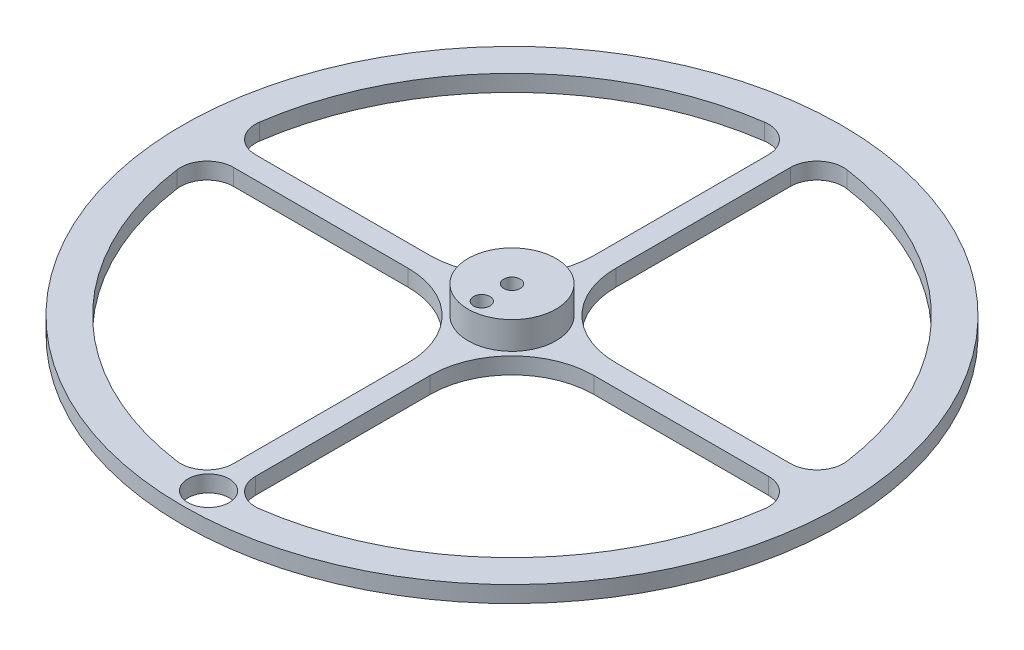
ISO-10303-21;
HEADER;
FILE_DESCRIPTION(('STEP AP214'),'2;1');
FILE_NAME('part.step','',(''),(''),'','','');
FILE_SCHEMA(('AUTOMOTIVE_DESIGN { 1 0 10303 214 1 1 1 1 }'));
ENDSEC;
DATA;
#1=APPLICATION_CONTEXT('core data for automotive mechanical design processes');
#2=APPLICATION_PROTOCOL_DEFINITION('international standard','automotive_design',2000,#1);
#3=PRODUCT_CONTEXT('',#1,'mechanical');
#4=PRODUCT('Part','Part','',(#3));
#5=PRODUCT_RELATED_PRODUCT_CATEGORY('part','',(#4));
#6=PRODUCT_DEFINITION_FORMATION('','',#4);
#7=PRODUCT_DEFINITION_CONTEXT('part definition',#1,'design');
#8=PRODUCT_DEFINITION('design','',#6,#7);
#9=PRODUCT_DEFINITION_SHAPE('','',#8);
#10=(LENGTH_UNIT() NAMED_UNIT(*) SI_UNIT(.MILLI.,.METRE.));
#11=(NAMED_UNIT(*) PLANE_ANGLE_UNIT() SI_UNIT($,.RADIAN.));
#12=(NAMED_UNIT(*) SI_UNIT($,.STERADIAN.) SOLID_ANGLE_UNIT());
#13=UNCERTAINTY_MEASURE_WITH_UNIT(LENGTH_MEASURE(1.E-05),#10,'distance_accuracy_value','');
#14=(GEOMETRIC_REPRESENTATION_CONTEXT(3) GLOBAL_UNCERTAINTY_ASSIGNED_CONTEXT((#13)) GLOBAL_UNIT_ASSIGNED_CONTEXT((#10,
#11,#12)) REPRESENTATION_CONTEXT('',''));
#15=CARTESIAN_POINT('',(0.,0.,0.));
#16=DIRECTION('',(0.,0.,1.));
#17=DIRECTION('',(1.,0.,0.));
#18=AXIS2_PLACEMENT_3D('',#15,#16,#17);
#19=CARTESIAN_POINT('',(0.,0.,0.));
#20=DIRECTION('',(0.,1.,0.));
#21=DIRECTION('',(0.,0.,1.));
#22=AXIS2_PLACEMENT_3D('',#19,#20,#21);
#23=PLANE('',#22);
#24=CARTESIAN_POINT('',(0.,0.,55.25));
#25=DIRECTION('',(0.,1.,0.));
#26=DIRECTION('',(0.,0.,1.));
#27=AXIS2_PLACEMENT_3D('',#24,#25,#26);
#28=CIRCLE('',#27,3.75);
#29=CARTESIAN_POINT('',(0.,0.,59.));
#30=VERTEX_POINT('',#29);
#31=EDGE_CURVE('E601',#30,#30,#28,.T.);
#32=ORIENTED_EDGE('',*,*,#31,.F.);
#33=EDGE_LOOP('',(#32));
#34=FACE_BOUND('',#33,.T.);
#35=CARTESIAN_POINT('',(0.,0.,0.));
#36=DIRECTION('',(0.,1.,0.));
#37=DIRECTION('',(0.,0.,1.));
#38=AXIS2_PLACEMENT_3D('',#35,#36,#37);
#39=CIRCLE('',#38,60.);
#40=CARTESIAN_POINT('',(0.,0.,60.));
#41=VERTEX_POINT('',#40);
#42=EDGE_CURVE('E293',#41,#41,#39,.T.);
#43=ORIENTED_EDGE('',*,*,#42,.T.);
#44=EDGE_LOOP('',(#43));
#45=FACE_BOUND('',#44,.T.);
#46=CARTESIAN_POINT('',(0.,0.,0.));
#47=DIRECTION('',(0.,1.,0.));
#48=DIRECTION('',(0.,0.,1.));
#49=AXIS2_PLACEMENT_3D('',#46,#47,#48);
#50=CIRCLE('',#49,54.);
#51=CARTESIAN_POINT('',(-53.4766304099277,0.,7.49999999999981));
#52=VERTEX_POINT('',#51);
#53=CARTESIAN_POINT('',(-7.5,0.,53.4766304099277));
#54=VERTEX_POINT('',#53);
#55=EDGE_CURVE('E238',#52,#54,#50,.T.);
#56=ORIENTED_EDGE('',*,*,#55,.F.);
#57=CARTESIAN_POINT('',(-48.6941677054723,0.,6.82926831760953));
#58=DIRECTION('',(0.,1.,0.));
#59=DIRECTION('',(0.,0.,1.));
#60=AXIS2_PLACEMENT_3D('',#57,#58,#59);
#61=CIRCLE('',#60,4.8292681132102);
#62=CARTESIAN_POINT('',(-48.6941677054723,0.,2.00000020439934));
#63=VERTEX_POINT('',#62);
#64=EDGE_CURVE('E282',#63,#52,#61,.T.);
#65=ORIENTED_EDGE('',*,*,#64,.F.);
#66=DIRECTION('',(1.,0.,0.));
#67=VECTOR('',#66,1.);
#68=CARTESIAN_POINT('',(0.,0.,2.00000020439951));
#69=LINE('',#68,#67);
#70=CARTESIAN_POINT('',(-16.8994944431475,0.,2.00000020439945));
#71=VERTEX_POINT('',#70);
#72=EDGE_CURVE('E284',#63,#71,#69,.T.);
#73=ORIENTED_EDGE('',*,*,#72,.T.);
#74=CARTESIAN_POINT('',(-16.8994944431475,0.,16.8994944431472));
#75=DIRECTION('',(0.,1.,0.));
#76=DIRECTION('',(0.,0.,1.));
#77=AXIS2_PLACEMENT_3D('',#74,#75,#76);
#78=CIRCLE('',#77,14.8994942387478);
#79=CARTESIAN_POINT('',(-2.00000020439951,0.,16.8994944431475));
#80=VERTEX_POINT('',#79);
#81=EDGE_CURVE('E287',#71,#80,#78,.F.);
#82=ORIENTED_EDGE('',*,*,#81,.T.);
#83=DIRECTION('',(0.,0.,1.));
#84=VECTOR('',#83,1.);
#85=CARTESIAN_POINT('',(-2.00000020439951,0.,0.));
#86=LINE('',#85,#84);
#87=CARTESIAN_POINT('',(-2.00000020439951,0.,48.6941677054723));
#88=VERTEX_POINT('',#87);
#89=EDGE_CURVE('E207',#80,#88,#86,.T.);
#90=ORIENTED_EDGE('',*,*,#89,.T.);
#91=CARTESIAN_POINT('',(-6.8292683176097,0.,48.6941677054723));
#92=DIRECTION('',(0.,1.,0.));
#93=DIRECTION('',(0.,0.,1.));
#94=AXIS2_PLACEMENT_3D('',#91,#92,#93);
#95=CIRCLE('',#94,4.82926811321019);
#96=EDGE_CURVE('E290',#88,#54,#95,.F.);
#97=ORIENTED_EDGE('',*,*,#96,.T.);
#98=EDGE_LOOP('',(#56,#65,#73,#82,#90,#97));
#99=FACE_BOUND('',#98,.T.);
#100=CARTESIAN_POINT('',(-7.49999999999963,0.,-53.4766304099277));
#101=VERTEX_POINT('',#100);
#102=CARTESIAN_POINT('',(-53.4766304099276,0.,-7.50000000000019));
#103=VERTEX_POINT('',#102);
#104=EDGE_CURVE('E267',#101,#103,#50,.T.);
#105=ORIENTED_EDGE('',*,*,#104,.F.);
#106=CARTESIAN_POINT('',(-6.82926831760936,0.,-48.6941677054723));
#107=DIRECTION('',(0.,1.,0.));
#108=DIRECTION('',(0.,0.,1.));
#109=AXIS2_PLACEMENT_3D('',#106,#107,#108);
#110=CIRCLE('',#109,4.82926811321019);
#111=CARTESIAN_POINT('',(-2.00000020439917,0.,-48.6941677054723));
#112=VERTEX_POINT('',#111);
#113=EDGE_CURVE('E268',#112,#101,#110,.T.);
#114=ORIENTED_EDGE('',*,*,#113,.F.);
#115=DIRECTION('',(0.,0.,1.));
#116=VECTOR('',#115,1.);
#117=CARTESIAN_POINT('',(-2.00000020439951,0.,0.));
#118=LINE('',#117,#116);
#119=CARTESIAN_POINT('',(-2.00000020439939,0.,-16.8994944431475));
#120=VERTEX_POINT('',#119);
#121=EDGE_CURVE('E270',#112,#120,#118,.T.);
#122=ORIENTED_EDGE('',*,*,#121,.T.);
#123=CARTESIAN_POINT('',(-16.8994944431471,0.,-16.8994944431476));
#124=DIRECTION('',(0.,1.,0.));
#125=DIRECTION('',(0.,0.,1.));
#126=AXIS2_PLACEMENT_3D('',#123,#124,#125);
#127=CIRCLE('',#126,14.8994942387477);
#128=CARTESIAN_POINT('',(-16.8994944431475,0.,-2.00000020439957));
#129=VERTEX_POINT('',#128);
#130=EDGE_CURVE('E273',#120,#129,#127,.F.);
#131=ORIENTED_EDGE('',*,*,#130,.T.);
#132=DIRECTION('',(-1.,0.,0.));
#133=VECTOR('',#132,1.);
#134=CARTESIAN_POINT('',(0.,0.,-2.00000020439951));
#135=LINE('',#134,#133);
#136=CARTESIAN_POINT('',(-48.6941677054723,0.,-2.00000020439968));
#137=VERTEX_POINT('',#136);
#138=EDGE_CURVE('E276',#129,#137,#135,.T.);
#139=ORIENTED_EDGE('',*,*,#138,.T.);
#140=CARTESIAN_POINT('',(-48.6941677054723,0.,-6.82926831760987));
#141=DIRECTION('',(0.,1.,0.));
#142=DIRECTION('',(0.,0.,1.));
#143=AXIS2_PLACEMENT_3D('',#140,#141,#142);
#144=CIRCLE('',#143,4.82926811321019);
#145=EDGE_CURVE('E279',#137,#103,#144,.F.);
#146=ORIENTED_EDGE('',*,*,#145,.T.);
#147=EDGE_LOOP('',(#105,#114,#122,#131,#139,#146));
#148=FACE_BOUND('',#147,.T.);
#149=CARTESIAN_POINT('',(53.4766304099277,0.,-7.49999999999944));
#150=VERTEX_POINT('',#149);
#151=CARTESIAN_POINT('',(7.50000000000037,0.,-53.4766304099276));
#152=VERTEX_POINT('',#151);
#153=EDGE_CURVE('E239',#150,#152,#50,.T.);
#154=ORIENTED_EDGE('',*,*,#153,.F.);
#155=CARTESIAN_POINT('',(48.6941677054724,0.,-6.82926831760919));
#156=DIRECTION('',(0.,1.,0.));
#157=DIRECTION('',(0.,0.,1.));
#158=AXIS2_PLACEMENT_3D('',#155,#156,#157);
#159=CIRCLE('',#158,4.82926811321019);
#160=CARTESIAN_POINT('',(48.6941677054723,0.,-2.000000204399));
#161=VERTEX_POINT('',#160);
#162=EDGE_CURVE('E253',#161,#150,#159,.T.);
#163=ORIENTED_EDGE('',*,*,#162,.F.);
#164=DIRECTION('',(-1.,0.,0.));
#165=VECTOR('',#164,1.);
#166=CARTESIAN_POINT('',(0.,0.,-2.00000020439951));
#167=LINE('',#166,#165);
#168=CARTESIAN_POINT('',(16.8994944431475,0.,-2.00000020439933));
#169=VERTEX_POINT('',#168);
#170=EDGE_CURVE('E255',#161,#169,#167,.T.);
#171=ORIENTED_EDGE('',*,*,#170,.T.);
#172=CARTESIAN_POINT('',(16.8994944431476,0.,-16.8994944431471));
#173=DIRECTION('',(0.,1.,0.));
#174=DIRECTION('',(0.,0.,1.));
#175=AXIS2_PLACEMENT_3D('',#172,#173,#174);
#176=CIRCLE('',#175,14.8994942387478);
#177=CARTESIAN_POINT('',(2.00000020439962,0.,-16.8994944431474));
#178=VERTEX_POINT('',#177);
#179=EDGE_CURVE('E258',#169,#178,#176,.F.);
#180=ORIENTED_EDGE('',*,*,#179,.T.);
#181=DIRECTION('',(0.,0.,-1.));
#182=VECTOR('',#181,1.);
#183=CARTESIAN_POINT('',(2.0000002043995,0.,0.));
#184=LINE('',#183,#182);
#185=CARTESIAN_POINT('',(2.00000020439984,0.,-48.6941677054723));
#186=VERTEX_POINT('',#185);
#187=EDGE_CURVE('E261',#178,#186,#184,.T.);
#188=ORIENTED_EDGE('',*,*,#187,.T.);
#189=CARTESIAN_POINT('',(6.82926831761003,0.,-48.6941677054722));
#190=DIRECTION('',(0.,1.,0.));
#191=DIRECTION('',(0.,0.,1.));
#192=AXIS2_PLACEMENT_3D('',#189,#190,#191);
#193=CIRCLE('',#192,4.82926811321019);
#194=EDGE_CURVE('E264',#186,#152,#193,.F.);
#195=ORIENTED_EDGE('',*,*,#194,.T.);
#196=EDGE_LOOP('',(#154,#163,#171,#180,#188,#195));
#197=FACE_BOUND('',#196,.T.);
#198=CARTESIAN_POINT('',(7.5,0.,53.4766304099277));
#199=VERTEX_POINT('',#198);
#200=CARTESIAN_POINT('',(53.4766304099276,0.,7.50000000000056));
#201=VERTEX_POINT('',#200);
#202=EDGE_CURVE('E233',#199,#201,#50,.T.);
#203=ORIENTED_EDGE('',*,*,#202,.F.);
#204=CARTESIAN_POINT('',(6.8292683176097,0.,48.6941677054723));
#205=DIRECTION('',(0.,1.,0.));
#206=DIRECTION('',(0.,0.,1.));
#207=AXIS2_PLACEMENT_3D('',#204,#205,#206);
#208=CIRCLE('',#207,4.82926811321019);
#209=CARTESIAN_POINT('',(2.00000020439951,0.,48.6941677054723));
#210=VERTEX_POINT('',#209);
#211=EDGE_CURVE('E236',#210,#199,#208,.T.);
#212=ORIENTED_EDGE('',*,*,#211,.F.);
#213=DIRECTION('',(0.,0.,-1.));
#214=VECTOR('',#213,1.);
#215=CARTESIAN_POINT('',(2.00000020439951,0.,0.));
#216=LINE('',#215,#214);
#217=CARTESIAN_POINT('',(2.00000020439951,0.,16.8994944431475));
#218=VERTEX_POINT('',#217);
#219=EDGE_CURVE('E241',#210,#218,#216,.T.);
#220=ORIENTED_EDGE('',*,*,#219,.T.);
#221=CARTESIAN_POINT('',(16.8994944431473,0.,16.8994944431475));
#222=DIRECTION('',(0.,1.,0.));
#223=DIRECTION('',(0.,0.,1.));
#224=AXIS2_PLACEMENT_3D('',#221,#222,#223);
#225=CIRCLE('',#224,14.8994942387478);
#226=CARTESIAN_POINT('',(16.8994944431474,0.,2.00000020439968));
#227=VERTEX_POINT('',#226);
#228=EDGE_CURVE('E244',#218,#227,#225,.F.);
#229=ORIENTED_EDGE('',*,*,#228,.T.);
#230=DIRECTION('',(1.,0.,0.));
#231=VECTOR('',#230,1.);
#232=CARTESIAN_POINT('',(0.,0.,2.00000020439951));
#233=LINE('',#232,#231);
#234=CARTESIAN_POINT('',(48.6941677054723,0.,2.00000020440002));
#235=VERTEX_POINT('',#234);
#236=EDGE_CURVE('E247',#227,#235,#233,.T.);
#237=ORIENTED_EDGE('',*,*,#236,.T.);
#238=CARTESIAN_POINT('',(48.6941677054722,0.,6.82926831761021));
#239=DIRECTION('',(0.,1.,0.));
#240=DIRECTION('',(0.,0.,1.));
#241=AXIS2_PLACEMENT_3D('',#238,#239,#240);
#242=CIRCLE('',#241,4.82926811321019);
#243=EDGE_CURVE('E250',#235,#201,#242,.F.);
#244=ORIENTED_EDGE('',*,*,#243,.T.);
#245=EDGE_LOOP('',(#203,#212,#220,#229,#237,#244));
#246=FACE_BOUND('',#245,.T.);
#247=CARTESIAN_POINT('',(0.,0.,0.));
#248=DIRECTION('',(0.,1.,0.));
#249=DIRECTION('',(0.,0.,1.));
#250=AXIS2_PLACEMENT_3D('',#247,#248,#249);
#251=CIRCLE('',#250,8.);
#252=CARTESIAN_POINT('',(0.,0.,8.));
#253=VERTEX_POINT('',#252);
#254=EDGE_CURVE('E618',#253,#253,#251,.T.);
#255=ORIENTED_EDGE('',*,*,#254,.F.);
#256=EDGE_LOOP('',(#255));
#257=FACE_BOUND('',#256,.T.);
#258=ADVANCED_FACE('F34',(#34,#45,#99,#148,#197,#246,#257),#23,.T.);
#259=CARTESIAN_POINT('',(0.,-3.,0.));
#260=DIRECTION('',(0.,1.,0.));
#261=DIRECTION('',(0.,0.,1.));
#262=AXIS2_PLACEMENT_3D('',#259,#260,#261);
#263=CYLINDRICAL_SURFACE('',#262,54.);
#264=ORIENTED_EDGE('',*,*,#55,.T.);
#265=DIRECTION('',(0.,1.,0.));
#266=VECTOR('',#265,1.);
#267=CARTESIAN_POINT('',(-7.5,-3.,53.4766304099277));
#268=LINE('',#267,#266);
#269=CARTESIAN_POINT('',(-7.5,-3.,53.4766304099277));
#270=VERTEX_POINT('',#269);
#271=EDGE_CURVE('E11',#270,#54,#268,.T.);
#272=ORIENTED_EDGE('',*,*,#271,.F.);
#273=CARTESIAN_POINT('',(0.,-3.,0.));
#274=DIRECTION('',(0.,1.,0.));
#275=DIRECTION('',(0.,0.,1.));
#276=AXIS2_PLACEMENT_3D('',#273,#274,#275);
#277=CIRCLE('',#276,54.);
#278=CARTESIAN_POINT('',(-53.4766304099277,-3.,7.49999999999981));
#279=VERTEX_POINT('',#278);
#280=EDGE_CURVE('E53',#279,#270,#277,.T.);
#281=ORIENTED_EDGE('',*,*,#280,.F.);
#282=DIRECTION('',(0.,1.,0.));
#283=VECTOR('',#282,1.);
#284=CARTESIAN_POINT('',(-53.4766304099277,-3.,7.49999999999981));
#285=LINE('',#284,#283);
#286=EDGE_CURVE('E301',#279,#52,#285,.T.);
#287=ORIENTED_EDGE('',*,*,#286,.T.);
#288=EDGE_LOOP('',(#264,#272,#281,#287));
#289=FACE_BOUND('',#288,.T.);
#290=ADVANCED_FACE('F422',(#289),#263,.F.);
#291=CARTESIAN_POINT('',(-6.8292683176097,-3.,48.6941677054723));
#292=DIRECTION('',(0.,1.,0.));
#293=DIRECTION('',(0.,0.,1.));
#294=AXIS2_PLACEMENT_3D('',#291,#292,#293);
#295=CYLINDRICAL_SURFACE('',#294,4.82926811321019);
#296=ORIENTED_EDGE('',*,*,#96,.F.);
#297=DIRECTION('',(0.,1.,0.));
#298=VECTOR('',#297,1.);
#299=CARTESIAN_POINT('',(-2.00000020439951,-3.,48.6941677054723));
#300=LINE('',#299,#298);
#301=CARTESIAN_POINT('',(-2.00000020439951,-3.,48.6941677054723));
#302=VERTEX_POINT('',#301);
#303=EDGE_CURVE('E44',#302,#88,#300,.T.);
#304=ORIENTED_EDGE('',*,*,#303,.F.);
#305=CARTESIAN_POINT('',(-6.8292683176097,-3.,48.6941677054723));
#306=DIRECTION('',(0.,1.,0.));
#307=DIRECTION('',(0.,0.,1.));
#308=AXIS2_PLACEMENT_3D('',#305,#306,#307);
#309=CIRCLE('',#308,4.82926811321019);
#310=EDGE_CURVE('E220',#302,#270,#309,.F.);
#311=ORIENTED_EDGE('',*,*,#310,.T.);
#312=ORIENTED_EDGE('',*,*,#271,.T.);
#313=EDGE_LOOP('',(#296,#304,#311,#312));
#314=FACE_BOUND('',#313,.T.);
#315=ADVANCED_FACE('F428',(#314),#295,.F.);
#316=CARTESIAN_POINT('',(-2.00000020439951,-3.,0.));
#317=DIRECTION('',(-1.,0.,0.));
#318=DIRECTION('',(0.,0.,1.));
#319=AXIS2_PLACEMENT_3D('',#316,#317,#318);
#320=PLANE('',#319);
#321=ORIENTED_EDGE('',*,*,#89,.F.);
#322=DIRECTION('',(0.,1.,0.));
#323=VECTOR('',#322,1.);
#324=CARTESIAN_POINT('',(-2.00000020439951,-3.,16.8994944431475));
#325=LINE('',#324,#323);
#326=CARTESIAN_POINT('',(-2.00000020439951,-3.,16.8994944431475));
#327=VERTEX_POINT('',#326);
#328=EDGE_CURVE('E203',#327,#80,#325,.T.);
#329=ORIENTED_EDGE('',*,*,#328,.F.);
#330=DIRECTION('',(0.,0.,1.));
#331=VECTOR('',#330,1.);
#332=CARTESIAN_POINT('',(-2.00000020439951,-3.,0.));
#333=LINE('',#332,#331);
#334=EDGE_CURVE('E206',#327,#302,#333,.T.);
#335=ORIENTED_EDGE('',*,*,#334,.T.);
#336=ORIENTED_EDGE('',*,*,#303,.T.);
#337=EDGE_LOOP('',(#321,#329,#335,#336));
#338=FACE_BOUND('',#337,.T.);
#339=ADVANCED_FACE('F205',(#338),#320,.T.);
#340=CARTESIAN_POINT('',(-16.8994944431475,-3.,16.8994944431472));
#341=DIRECTION('',(0.,1.,0.));
#342=DIRECTION('',(0.,0.,1.));
#343=AXIS2_PLACEMENT_3D('',#340,#341,#342);
#344=CYLINDRICAL_SURFACE('',#343,14.8994942387478);
#345=ORIENTED_EDGE('',*,*,#81,.F.);
#346=DIRECTION('',(0.,1.,0.));
#347=VECTOR('',#346,1.);
#348=CARTESIAN_POINT('',(-16.8994944431475,-3.,2.00000020439945));
#349=LINE('',#348,#347);
#350=CARTESIAN_POINT('',(-16.8994944431475,-3.,2.00000020439945));
#351=VERTEX_POINT('',#350);
#352=EDGE_CURVE('E212',#351,#71,#349,.T.);
#353=ORIENTED_EDGE('',*,*,#352,.F.);
#354=CARTESIAN_POINT('',(-16.8994944431475,-3.,16.8994944431472));
#355=DIRECTION('',(0.,1.,0.));
#356=DIRECTION('',(0.,0.,1.));
#357=AXIS2_PLACEMENT_3D('',#354,#355,#356);
#358=CIRCLE('',#357,14.8994942387478);
#359=EDGE_CURVE('E218',#351,#327,#358,.F.);
#360=ORIENTED_EDGE('',*,*,#359,.T.);
#361=ORIENTED_EDGE('',*,*,#328,.T.);
#362=EDGE_LOOP('',(#345,#353,#360,#361));
#363=FACE_BOUND('',#362,.T.);
#364=ADVANCED_FACE('F222',(#363),#344,.F.);
#365=CARTESIAN_POINT('',(0.,-3.,2.00000020439951));
#366=DIRECTION('',(0.,0.,1.));
#367=DIRECTION('',(1.,0.,0.));
#368=AXIS2_PLACEMENT_3D('',#365,#366,#367);
#369=PLANE('',#368);
#370=ORIENTED_EDGE('',*,*,#72,.F.);
#371=DIRECTION('',(0.,1.,0.));
#372=VECTOR('',#371,1.);
#373=CARTESIAN_POINT('',(-48.6941677054723,-3.,2.00000020439934));
#374=LINE('',#373,#372);
#375=CARTESIAN_POINT('',(-48.6941677054723,-3.,2.00000020439934));
#376=VERTEX_POINT('',#375);
#377=EDGE_CURVE('E299',#376,#63,#374,.T.);
#378=ORIENTED_EDGE('',*,*,#377,.F.);
#379=DIRECTION('',(1.,0.,0.));
#380=VECTOR('',#379,1.);
#381=CARTESIAN_POINT('',(0.,-3.,2.00000020439951));
#382=LINE('',#381,#380);
#383=EDGE_CURVE('E223',#376,#351,#382,.T.);
#384=ORIENTED_EDGE('',*,*,#383,.T.);
#385=ORIENTED_EDGE('',*,*,#352,.T.);
#386=EDGE_LOOP('',(#370,#378,#384,#385));
#387=FACE_BOUND('',#386,.T.);
#388=ADVANCED_FACE('F443',(#387),#369,.T.);
#389=ORIENTED_EDGE('',*,*,#104,.T.);
#390=DIRECTION('',(0.,1.,0.));
#391=VECTOR('',#390,1.);
#392=CARTESIAN_POINT('',(-53.4766304099276,-3.,-7.50000000000019));
#393=LINE('',#392,#391);
#394=CARTESIAN_POINT('',(-53.4766304099276,-3.,-7.50000000000019));
#395=VERTEX_POINT('',#394);
#396=EDGE_CURVE('E304',#395,#103,#393,.T.);
#397=ORIENTED_EDGE('',*,*,#396,.F.);
#398=CARTESIAN_POINT('',(-7.49999999999963,-3.,-53.4766304099277));
#399=VERTEX_POINT('',#398);
#400=EDGE_CURVE('E363',#399,#395,#277,.T.);
#401=ORIENTED_EDGE('',*,*,#400,.F.);
#402=DIRECTION('',(0.,1.,0.));
#403=VECTOR('',#402,1.);
#404=CARTESIAN_POINT('',(-7.49999999999963,-3.,-53.4766304099277));
#405=LINE('',#404,#403);
#406=EDGE_CURVE('E314',#399,#101,#405,.T.);
#407=ORIENTED_EDGE('',*,*,#406,.T.);
#408=EDGE_LOOP('',(#389,#397,#401,#407));
#409=FACE_BOUND('',#408,.T.);
#410=ADVANCED_FACE('F431',(#409),#263,.F.);
#411=CARTESIAN_POINT('',(-48.6941677054723,-3.,-6.82926831760987));
#412=DIRECTION('',(0.,1.,0.));
#413=DIRECTION('',(0.,0.,1.));
#414=AXIS2_PLACEMENT_3D('',#411,#412,#413);
#415=CYLINDRICAL_SURFACE('',#414,4.82926811321019);
#416=ORIENTED_EDGE('',*,*,#145,.F.);
#417=DIRECTION('',(0.,1.,0.));
#418=VECTOR('',#417,1.);
#419=CARTESIAN_POINT('',(-48.6941677054723,-3.,-2.00000020439968));
#420=LINE('',#419,#418);
#421=CARTESIAN_POINT('',(-48.6941677054723,-3.,-2.00000020439968));
#422=VERTEX_POINT('',#421);
#423=EDGE_CURVE('E306',#422,#137,#420,.T.);
#424=ORIENTED_EDGE('',*,*,#423,.F.);
#425=CARTESIAN_POINT('',(-48.6941677054723,-3.,-6.82926831760987));
#426=DIRECTION('',(0.,1.,0.));
#427=DIRECTION('',(0.,0.,1.));
#428=AXIS2_PLACEMENT_3D('',#425,#426,#427);
#429=CIRCLE('',#428,4.82926811321019);
#430=EDGE_CURVE('E392',#422,#395,#429,.F.);
#431=ORIENTED_EDGE('',*,*,#430,.T.);
#432=ORIENTED_EDGE('',*,*,#396,.T.);
#433=EDGE_LOOP('',(#416,#424,#431,#432));
#434=FACE_BOUND('',#433,.T.);
#435=ADVANCED_FACE('F451',(#434),#415,.F.);
#436=CARTESIAN_POINT('',(0.,-3.,-2.00000020439951));
#437=DIRECTION('',(0.,0.,-1.));
#438=DIRECTION('',(-1.,0.,0.));
#439=AXIS2_PLACEMENT_3D('',#436,#437,#438);
#440=PLANE('',#439);
#441=ORIENTED_EDGE('',*,*,#138,.F.);
#442=DIRECTION('',(0.,1.,0.));
#443=VECTOR('',#442,1.);
#444=CARTESIAN_POINT('',(-16.8994944431475,-3.,-2.00000020439957));
#445=LINE('',#444,#443);
#446=CARTESIAN_POINT('',(-16.8994944431475,-3.,-2.00000020439957));
#447=VERTEX_POINT('',#446);
#448=EDGE_CURVE('E308',#447,#129,#445,.T.);
#449=ORIENTED_EDGE('',*,*,#448,.F.);
#450=DIRECTION('',(-1.,0.,0.));
#451=VECTOR('',#450,1.);
#452=CARTESIAN_POINT('',(0.,-3.,-2.00000020439951));
#453=LINE('',#452,#451);
#454=EDGE_CURVE('E389',#447,#422,#453,.T.);
#455=ORIENTED_EDGE('',*,*,#454,.T.);
#456=ORIENTED_EDGE('',*,*,#423,.T.);
#457=EDGE_LOOP('',(#441,#449,#455,#456));
#458=FACE_BOUND('',#457,.T.);
#459=ADVANCED_FACE('F454',(#458),#440,.T.);
#460=CARTESIAN_POINT('',(-16.8994944431471,-3.,-16.8994944431476));
#461=DIRECTION('',(0.,1.,0.));
#462=DIRECTION('',(0.,0.,1.));
#463=AXIS2_PLACEMENT_3D('',#460,#461,#462);
#464=CYLINDRICAL_SURFACE('',#463,14.8994942387477);
#465=ORIENTED_EDGE('',*,*,#130,.F.);
#466=DIRECTION('',(0.,1.,0.));
#467=VECTOR('',#466,1.);
#468=CARTESIAN_POINT('',(-2.00000020439939,-3.,-16.8994944431475));
#469=LINE('',#468,#467);
#470=CARTESIAN_POINT('',(-2.00000020439939,-3.,-16.8994944431475));
#471=VERTEX_POINT('',#470);
#472=EDGE_CURVE('E310',#471,#120,#469,.T.);
#473=ORIENTED_EDGE('',*,*,#472,.F.);
#474=CARTESIAN_POINT('',(-16.8994944431471,-3.,-16.8994944431476));
#475=DIRECTION('',(0.,1.,0.));
#476=DIRECTION('',(0.,0.,1.));
#477=AXIS2_PLACEMENT_3D('',#474,#475,#476);
#478=CIRCLE('',#477,14.8994942387477);
#479=EDGE_CURVE('E386',#471,#447,#478,.F.);
#480=ORIENTED_EDGE('',*,*,#479,.T.);
#481=ORIENTED_EDGE('',*,*,#448,.T.);
#482=EDGE_LOOP('',(#465,#473,#480,#481));
#483=FACE_BOUND('',#482,.T.);
#484=ADVANCED_FACE('F458',(#483),#464,.F.);
#485=CARTESIAN_POINT('',(-2.00000020439951,-3.,0.));
#486=DIRECTION('',(-1.,0.,0.));
#487=DIRECTION('',(0.,0.,1.));
#488=AXIS2_PLACEMENT_3D('',#485,#486,#487);
#489=PLANE('',#488);
#490=ORIENTED_EDGE('',*,*,#121,.F.);
#491=DIRECTION('',(0.,1.,0.));
#492=VECTOR('',#491,1.);
#493=CARTESIAN_POINT('',(-2.00000020439917,-3.,-48.6941677054723));
#494=LINE('',#493,#492);
#495=CARTESIAN_POINT('',(-2.00000020439917,-3.,-48.6941677054723));
#496=VERTEX_POINT('',#495);
#497=EDGE_CURVE('E312',#496,#112,#494,.T.);
#498=ORIENTED_EDGE('',*,*,#497,.F.);
#499=DIRECTION('',(0.,0.,1.));
#500=VECTOR('',#499,1.);
#501=CARTESIAN_POINT('',(-2.00000020439951,-3.,0.));
#502=LINE('',#501,#500);
#503=EDGE_CURVE('E383',#496,#471,#502,.T.);
#504=ORIENTED_EDGE('',*,*,#503,.T.);
#505=ORIENTED_EDGE('',*,*,#472,.T.);
#506=EDGE_LOOP('',(#490,#498,#504,#505));
#507=FACE_BOUND('',#506,.T.);
#508=ADVANCED_FACE('F462',(#507),#489,.T.);
#509=ORIENTED_EDGE('',*,*,#153,.T.);
#510=DIRECTION('',(0.,1.,0.));
#511=VECTOR('',#510,1.);
#512=CARTESIAN_POINT('',(7.50000000000037,-3.,-53.4766304099276));
#513=LINE('',#512,#511);
#514=CARTESIAN_POINT('',(7.50000000000037,-3.,-53.4766304099276));
#515=VERTEX_POINT('',#514);
#516=EDGE_CURVE('E317',#515,#152,#513,.T.);
#517=ORIENTED_EDGE('',*,*,#516,.F.);
#518=CARTESIAN_POINT('',(53.4766304099277,-3.,-7.49999999999944));
#519=VERTEX_POINT('',#518);
#520=EDGE_CURVE('E358',#519,#515,#277,.T.);
#521=ORIENTED_EDGE('',*,*,#520,.F.);
#522=DIRECTION('',(0.,1.,0.));
#523=VECTOR('',#522,1.);
#524=CARTESIAN_POINT('',(53.4766304099277,-3.,-7.49999999999944));
#525=LINE('',#524,#523);
#526=EDGE_CURVE('E327',#519,#150,#525,.T.);
#527=ORIENTED_EDGE('',*,*,#526,.T.);
#528=EDGE_LOOP('',(#509,#517,#521,#527));
#529=FACE_BOUND('',#528,.T.);
#530=ADVANCED_FACE('F466',(#529),#263,.F.);
#531=CARTESIAN_POINT('',(6.82926831761003,-3.,-48.6941677054722));
#532=DIRECTION('',(0.,1.,0.));
#533=DIRECTION('',(0.,0.,1.));
#534=AXIS2_PLACEMENT_3D('',#531,#532,#533);
#535=CYLINDRICAL_SURFACE('',#534,4.82926811321019);
#536=ORIENTED_EDGE('',*,*,#194,.F.);
#537=DIRECTION('',(0.,1.,0.));
#538=VECTOR('',#537,1.);
#539=CARTESIAN_POINT('',(2.00000020439984,-3.,-48.6941677054723));
#540=LINE('',#539,#538);
#541=CARTESIAN_POINT('',(2.00000020439984,-3.,-48.6941677054723));
#542=VERTEX_POINT('',#541);
#543=EDGE_CURVE('E319',#542,#186,#540,.T.);
#544=ORIENTED_EDGE('',*,*,#543,.F.);
#545=CARTESIAN_POINT('',(6.82926831761003,-3.,-48.6941677054722));
#546=DIRECTION('',(0.,1.,0.));
#547=DIRECTION('',(0.,0.,1.));
#548=AXIS2_PLACEMENT_3D('',#545,#546,#547);
#549=CIRCLE('',#548,4.82926811321019);
#550=EDGE_CURVE('E378',#542,#515,#549,.F.);
#551=ORIENTED_EDGE('',*,*,#550,.T.);
#552=ORIENTED_EDGE('',*,*,#516,.T.);
#553=EDGE_LOOP('',(#536,#544,#551,#552));
#554=FACE_BOUND('',#553,.T.);
#555=ADVANCED_FACE('F471',(#554),#535,.F.);
#556=CARTESIAN_POINT('',(2.0000002043995,-3.,0.));
#557=DIRECTION('',(1.,0.,0.));
#558=DIRECTION('',(0.,0.,-1.));
#559=AXIS2_PLACEMENT_3D('',#556,#557,#558);
#560=PLANE('',#559);
#561=ORIENTED_EDGE('',*,*,#187,.F.);
#562=DIRECTION('',(0.,1.,0.));
#563=VECTOR('',#562,1.);
#564=CARTESIAN_POINT('',(2.00000020439962,-3.,-16.8994944431474));
#565=LINE('',#564,#563);
#566=CARTESIAN_POINT('',(2.00000020439962,-3.,-16.8994944431474));
#567=VERTEX_POINT('',#566);
#568=EDGE_CURVE('E321',#567,#178,#565,.T.);
#569=ORIENTED_EDGE('',*,*,#568,.F.);
#570=DIRECTION('',(0.,0.,-1.));
#571=VECTOR('',#570,1.);
#572=CARTESIAN_POINT('',(2.0000002043995,-3.,0.));
#573=LINE('',#572,#571);
#574=EDGE_CURVE('E375',#567,#542,#573,.T.);
#575=ORIENTED_EDGE('',*,*,#574,.T.);
#576=ORIENTED_EDGE('',*,*,#543,.T.);
#577=EDGE_LOOP('',(#561,#569,#575,#576));
#578=FACE_BOUND('',#577,.T.);
#579=ADVANCED_FACE('F474',(#578),#560,.T.);
#580=CARTESIAN_POINT('',(16.8994944431476,-3.,-16.8994944431471));
#581=DIRECTION('',(0.,1.,0.));
#582=DIRECTION('',(0.,0.,1.));
#583=AXIS2_PLACEMENT_3D('',#580,#581,#582);
#584=CYLINDRICAL_SURFACE('',#583,14.8994942387478);
#585=ORIENTED_EDGE('',*,*,#179,.F.);
#586=DIRECTION('',(0.,1.,0.));
#587=VECTOR('',#586,1.);
#588=CARTESIAN_POINT('',(16.8994944431475,-3.,-2.00000020439933));
#589=LINE('',#588,#587);
#590=CARTESIAN_POINT('',(16.8994944431475,-3.,-2.00000020439933));
#591=VERTEX_POINT('',#590);
#592=EDGE_CURVE('E323',#591,#169,#589,.T.);
#593=ORIENTED_EDGE('',*,*,#592,.F.);
#594=CARTESIAN_POINT('',(16.8994944431476,-3.,-16.8994944431471));
#595=DIRECTION('',(0.,1.,0.));
#596=DIRECTION('',(0.,0.,1.));
#597=AXIS2_PLACEMENT_3D('',#594,#595,#596);
#598=CIRCLE('',#597,14.8994942387478);
#599=EDGE_CURVE('E372',#591,#567,#598,.F.);
#600=ORIENTED_EDGE('',*,*,#599,.T.);
#601=ORIENTED_EDGE('',*,*,#568,.T.);
#602=EDGE_LOOP('',(#585,#593,#600,#601));
#603=FACE_BOUND('',#602,.T.);
#604=ADVANCED_FACE('F478',(#603),#584,.F.);
#605=CARTESIAN_POINT('',(0.,-3.,-2.00000020439951));
#606=DIRECTION('',(0.,0.,-1.));
#607=DIRECTION('',(-1.,0.,0.));
#608=AXIS2_PLACEMENT_3D('',#605,#606,#607);
#609=PLANE('',#608);
#610=ORIENTED_EDGE('',*,*,#170,.F.);
#611=DIRECTION('',(0.,1.,0.));
#612=VECTOR('',#611,1.);
#613=CARTESIAN_POINT('',(48.6941677054723,-3.,-2.000000204399));
#614=LINE('',#613,#612);
#615=CARTESIAN_POINT('',(48.6941677054723,-3.,-2.000000204399));
#616=VERTEX_POINT('',#615);
#617=EDGE_CURVE('E325',#616,#161,#614,.T.);
#618=ORIENTED_EDGE('',*,*,#617,.F.);
#619=DIRECTION('',(-1.,0.,0.));
#620=VECTOR('',#619,1.);
#621=CARTESIAN_POINT('',(0.,-3.,-2.00000020439951));
#622=LINE('',#621,#620);
#623=EDGE_CURVE('E369',#616,#591,#622,.T.);
#624=ORIENTED_EDGE('',*,*,#623,.T.);
#625=ORIENTED_EDGE('',*,*,#592,.T.);
#626=EDGE_LOOP('',(#610,#618,#624,#625));
#627=FACE_BOUND('',#626,.T.);
#628=ADVANCED_FACE('F482',(#627),#609,.T.);
#629=ORIENTED_EDGE('',*,*,#202,.T.);
#630=DIRECTION('',(0.,1.,0.));
#631=VECTOR('',#630,1.);
#632=CARTESIAN_POINT('',(53.4766304099276,-3.,7.50000000000056));
#633=LINE('',#632,#631);
#634=CARTESIAN_POINT('',(53.4766304099276,-3.,7.50000000000056));
#635=VERTEX_POINT('',#634);
#636=EDGE_CURVE('E330',#635,#201,#633,.T.);
#637=ORIENTED_EDGE('',*,*,#636,.F.);
#638=CARTESIAN_POINT('',(7.5,-3.,53.4766304099277));
#639=VERTEX_POINT('',#638);
#640=EDGE_CURVE('E295',#639,#635,#277,.T.);
#641=ORIENTED_EDGE('',*,*,#640,.F.);
#642=DIRECTION('',(0.,1.,0.));
#643=VECTOR('',#642,1.);
#644=CARTESIAN_POINT('',(7.5,-3.,53.4766304099277));
#645=LINE('',#644,#643);
#646=EDGE_CURVE('E38',#639,#199,#645,.T.);
#647=ORIENTED_EDGE('',*,*,#646,.T.);
#648=EDGE_LOOP('',(#629,#637,#641,#647));
#649=FACE_BOUND('',#648,.T.);
#650=ADVANCED_FACE('F344',(#649),#263,.F.);
#651=CARTESIAN_POINT('',(48.6941677054722,-3.,6.82926831761021));
#652=DIRECTION('',(0.,1.,0.));
#653=DIRECTION('',(0.,0.,1.));
#654=AXIS2_PLACEMENT_3D('',#651,#652,#653);
#655=CYLINDRICAL_SURFACE('',#654,4.82926811321019);
#656=ORIENTED_EDGE('',*,*,#243,.F.);
#657=DIRECTION('',(0.,1.,0.));
#658=VECTOR('',#657,1.);
#659=CARTESIAN_POINT('',(48.6941677054723,-3.,2.00000020440002));
#660=LINE('',#659,#658);
#661=CARTESIAN_POINT('',(48.6941677054723,-3.,2.00000020440002));
#662=VERTEX_POINT('',#661);
#663=EDGE_CURVE('E332',#662,#235,#660,.T.);
#664=ORIENTED_EDGE('',*,*,#663,.F.);
#665=CARTESIAN_POINT('',(48.6941677054722,-3.,6.82926831761021));
#666=DIRECTION('',(0.,1.,0.));
#667=DIRECTION('',(0.,0.,1.));
#668=AXIS2_PLACEMENT_3D('',#665,#666,#667);
#669=CIRCLE('',#668,4.82926811321019);
#670=EDGE_CURVE('E356',#662,#635,#669,.F.);
#671=ORIENTED_EDGE('',*,*,#670,.T.);
#672=ORIENTED_EDGE('',*,*,#636,.T.);
#673=EDGE_LOOP('',(#656,#664,#671,#672));
#674=FACE_BOUND('',#673,.T.);
#675=ADVANCED_FACE('F352',(#674),#655,.F.);
#676=CARTESIAN_POINT('',(0.,-3.,2.00000020439951));
#677=DIRECTION('',(0.,0.,1.));
#678=DIRECTION('',(1.,0.,0.));
#679=AXIS2_PLACEMENT_3D('',#676,#677,#678);
#680=PLANE('',#679);
#681=ORIENTED_EDGE('',*,*,#236,.F.);
#682=DIRECTION('',(0.,1.,0.));
#683=VECTOR('',#682,1.);
#684=CARTESIAN_POINT('',(16.8994944431474,-3.,2.00000020439968));
#685=LINE('',#684,#683);
#686=CARTESIAN_POINT('',(16.8994944431474,-3.,2.00000020439968));
#687=VERTEX_POINT('',#686);
#688=EDGE_CURVE('E334',#687,#227,#685,.T.);
#689=ORIENTED_EDGE('',*,*,#688,.F.);
#690=DIRECTION('',(1.,0.,0.));
#691=VECTOR('',#690,1.);
#692=CARTESIAN_POINT('',(0.,-3.,2.00000020439951));
#693=LINE('',#692,#691);
#694=EDGE_CURVE('E359',#687,#662,#693,.T.);
#695=ORIENTED_EDGE('',*,*,#694,.T.);
#696=ORIENTED_EDGE('',*,*,#663,.T.);
#697=EDGE_LOOP('',(#681,#689,#695,#696));
#698=FACE_BOUND('',#697,.T.);
#699=ADVANCED_FACE('F489',(#698),#680,.T.);
#700=CARTESIAN_POINT('',(16.8994944431473,-3.,16.8994944431475));
#701=DIRECTION('',(0.,1.,0.));
#702=DIRECTION('',(0.,0.,1.));
#703=AXIS2_PLACEMENT_3D('',#700,#701,#702);
#704=CYLINDRICAL_SURFACE('',#703,14.8994942387478);
#705=ORIENTED_EDGE('',*,*,#228,.F.);
#706=DIRECTION('',(0.,1.,0.));
#707=VECTOR('',#706,1.);
#708=CARTESIAN_POINT('',(2.00000020439951,-3.,16.8994944431475));
#709=LINE('',#708,#707);
#710=CARTESIAN_POINT('',(2.00000020439951,-3.,16.8994944431475));
#711=VERTEX_POINT('',#710);
#712=EDGE_CURVE('E336',#711,#218,#709,.T.);
#713=ORIENTED_EDGE('',*,*,#712,.F.);
#714=CARTESIAN_POINT('',(16.8994944431473,-3.,16.8994944431475));
#715=DIRECTION('',(0.,1.,0.));
#716=DIRECTION('',(0.,0.,1.));
#717=AXIS2_PLACEMENT_3D('',#714,#715,#716);
#718=CIRCLE('',#717,14.8994942387478);
#719=EDGE_CURVE('E364',#711,#687,#718,.F.);
#720=ORIENTED_EDGE('',*,*,#719,.T.);
#721=ORIENTED_EDGE('',*,*,#688,.T.);
#722=EDGE_LOOP('',(#705,#713,#720,#721));
#723=FACE_BOUND('',#722,.T.);
#724=ADVANCED_FACE('F405',(#723),#704,.F.);
#725=CARTESIAN_POINT('',(2.00000020439951,-3.,0.));
#726=DIRECTION('',(1.,0.,0.));
#727=DIRECTION('',(0.,0.,-1.));
#728=AXIS2_PLACEMENT_3D('',#725,#726,#727);
#729=PLANE('',#728);
#730=ORIENTED_EDGE('',*,*,#219,.F.);
#731=DIRECTION('',(0.,1.,0.));
#732=VECTOR('',#731,1.);
#733=CARTESIAN_POINT('',(2.00000020439951,-3.,48.6941677054723));
#734=LINE('',#733,#732);
#735=CARTESIAN_POINT('',(2.00000020439951,-3.,48.6941677054723));
#736=VERTEX_POINT('',#735);
#737=EDGE_CURVE('E337',#736,#210,#734,.T.);
#738=ORIENTED_EDGE('',*,*,#737,.F.);
#739=DIRECTION('',(0.,0.,-1.));
#740=VECTOR('',#739,1.);
#741=CARTESIAN_POINT('',(2.00000020439951,-3.,0.));
#742=LINE('',#741,#740);
#743=EDGE_CURVE('E398',#736,#711,#742,.T.);
#744=ORIENTED_EDGE('',*,*,#743,.T.);
#745=ORIENTED_EDGE('',*,*,#712,.T.);
#746=EDGE_LOOP('',(#730,#738,#744,#745));
#747=FACE_BOUND('',#746,.T.);
#748=ADVANCED_FACE('F408',(#747),#729,.T.);
#749=CARTESIAN_POINT('',(-48.6941677054723,-3.,6.82926831760953));
#750=DIRECTION('',(0.,1.,0.));
#751=DIRECTION('',(0.,0.,1.));
#752=AXIS2_PLACEMENT_3D('',#749,#750,#751);
#753=CYLINDRICAL_SURFACE('',#752,4.8292681132102);
#754=ORIENTED_EDGE('',*,*,#64,.T.);
#755=ORIENTED_EDGE('',*,*,#286,.F.);
#756=CARTESIAN_POINT('',(-48.6941677054723,-3.,6.82926831760953));
#757=DIRECTION('',(0.,1.,0.));
#758=DIRECTION('',(0.,0.,1.));
#759=AXIS2_PLACEMENT_3D('',#756,#757,#758);
#760=CIRCLE('',#759,4.8292681132102);
#761=EDGE_CURVE('E225',#376,#279,#760,.T.);
#762=ORIENTED_EDGE('',*,*,#761,.F.);
#763=ORIENTED_EDGE('',*,*,#377,.T.);
#764=EDGE_LOOP('',(#754,#755,#762,#763));
#765=FACE_BOUND('',#764,.T.);
#766=ADVANCED_FACE('F447',(#765),#753,.F.);
#767=CARTESIAN_POINT('',(-6.82926831760936,-3.,-48.6941677054723));
#768=DIRECTION('',(0.,1.,0.));
#769=DIRECTION('',(0.,0.,1.));
#770=AXIS2_PLACEMENT_3D('',#767,#768,#769);
#771=CYLINDRICAL_SURFACE('',#770,4.82926811321019);
#772=ORIENTED_EDGE('',*,*,#113,.T.);
#773=ORIENTED_EDGE('',*,*,#406,.F.);
#774=CARTESIAN_POINT('',(-6.82926831760936,-3.,-48.6941677054723));
#775=DIRECTION('',(0.,1.,0.));
#776=DIRECTION('',(0.,0.,1.));
#777=AXIS2_PLACEMENT_3D('',#774,#775,#776);
#778=CIRCLE('',#777,4.82926811321019);
#779=EDGE_CURVE('E381',#496,#399,#778,.T.);
#780=ORIENTED_EDGE('',*,*,#779,.F.);
#781=ORIENTED_EDGE('',*,*,#497,.T.);
#782=EDGE_LOOP('',(#772,#773,#780,#781));
#783=FACE_BOUND('',#782,.T.);
#784=ADVANCED_FACE('F418',(#783),#771,.F.);
#785=CARTESIAN_POINT('',(48.6941677054724,-3.,-6.82926831760919));
#786=DIRECTION('',(0.,1.,0.));
#787=DIRECTION('',(0.,0.,1.));
#788=AXIS2_PLACEMENT_3D('',#785,#786,#787);
#789=CYLINDRICAL_SURFACE('',#788,4.82926811321019);
#790=ORIENTED_EDGE('',*,*,#162,.T.);
#791=ORIENTED_EDGE('',*,*,#526,.F.);
#792=CARTESIAN_POINT('',(48.6941677054724,-3.,-6.82926831760919));
#793=DIRECTION('',(0.,1.,0.));
#794=DIRECTION('',(0.,0.,1.));
#795=AXIS2_PLACEMENT_3D('',#792,#793,#794);
#796=CIRCLE('',#795,4.82926811321019);
#797=EDGE_CURVE('E361',#616,#519,#796,.T.);
#798=ORIENTED_EDGE('',*,*,#797,.F.);
#799=ORIENTED_EDGE('',*,*,#617,.T.);
#800=EDGE_LOOP('',(#790,#791,#798,#799));
#801=FACE_BOUND('',#800,.T.);
#802=ADVANCED_FACE('F411',(#801),#789,.F.);
#803=CARTESIAN_POINT('',(6.8292683176097,-3.,48.6941677054723));
#804=DIRECTION('',(0.,1.,0.));
#805=DIRECTION('',(0.,0.,1.));
#806=AXIS2_PLACEMENT_3D('',#803,#804,#805);
#807=CYLINDRICAL_SURFACE('',#806,4.82926811321019);
#808=ORIENTED_EDGE('',*,*,#211,.T.);
#809=ORIENTED_EDGE('',*,*,#646,.F.);
#810=CARTESIAN_POINT('',(6.8292683176097,-3.,48.6941677054723));
#811=DIRECTION('',(0.,1.,0.));
#812=DIRECTION('',(0.,0.,1.));
#813=AXIS2_PLACEMENT_3D('',#810,#811,#812);
#814=CIRCLE('',#813,4.82926811321019);
#815=EDGE_CURVE('E143',#736,#639,#814,.T.);
#816=ORIENTED_EDGE('',*,*,#815,.F.);
#817=ORIENTED_EDGE('',*,*,#737,.T.);
#818=EDGE_LOOP('',(#808,#809,#816,#817));
#819=FACE_BOUND('',#818,.T.);
#820=ADVANCED_FACE('F36',(#819),#807,.F.);
#821=CARTESIAN_POINT('',(0.,-3.,0.));
#822=DIRECTION('',(0.,1.,0.));
#823=DIRECTION('',(0.,0.,1.));
#824=AXIS2_PLACEMENT_3D('',#821,#822,#823);
#825=CYLINDRICAL_SURFACE('',#824,60.);
#826=CARTESIAN_POINT('',(0.,-3.,0.));
#827=DIRECTION('',(0.,1.,0.));
#828=DIRECTION('',(0.,0.,1.));
#829=AXIS2_PLACEMENT_3D('',#826,#827,#828);
#830=CIRCLE('',#829,60.);
#831=CARTESIAN_POINT('',(0.,-3.,60.));
#832=VERTEX_POINT('',#831);
#833=EDGE_CURVE('E230',#832,#832,#830,.T.);
#834=ORIENTED_EDGE('',*,*,#833,.T.);
#835=EDGE_LOOP('',(#834));
#836=FACE_BOUND('',#835,.T.);
#837=ORIENTED_EDGE('',*,*,#42,.F.);
#838=EDGE_LOOP('',(#837));
#839=FACE_BOUND('',#838,.T.);
#840=ADVANCED_FACE('F410',(#836,#839),#825,.T.);
#841=CARTESIAN_POINT('',(0.,-3.,0.));
#842=DIRECTION('',(0.,1.,0.));
#843=DIRECTION('',(0.,0.,1.));
#844=AXIS2_PLACEMENT_3D('',#841,#842,#843);
#845=PLANE('',#844);
#846=CARTESIAN_POINT('',(0.,-3.,55.25));
#847=DIRECTION('',(0.,1.,0.));
#848=DIRECTION('',(0.,0.,1.));
#849=AXIS2_PLACEMENT_3D('',#846,#847,#848);
#850=CIRCLE('',#849,3.75);
#851=CARTESIAN_POINT('',(0.,-3.,59.));
#852=VERTEX_POINT('',#851);
#853=EDGE_CURVE('E605',#852,#852,#850,.F.);
#854=ORIENTED_EDGE('',*,*,#853,.F.);
#855=EDGE_LOOP('',(#854));
#856=FACE_BOUND('',#855,.T.);
#857=CARTESIAN_POINT('',(0.,-3.,0.));
#858=DIRECTION('',(0.,1.,0.));
#859=DIRECTION('',(0.,0.,1.));
#860=AXIS2_PLACEMENT_3D('',#857,#858,#859);
#861=CIRCLE('',#860,1.5);
#862=CARTESIAN_POINT('',(0.,-3.,1.5));
#863=VERTEX_POINT('',#862);
#864=EDGE_CURVE('E615',#863,#863,#861,.F.);
#865=ORIENTED_EDGE('',*,*,#864,.F.);
#866=EDGE_LOOP('',(#865));
#867=FACE_BOUND('',#866,.T.);
#868=ORIENTED_EDGE('',*,*,#640,.T.);
#869=ORIENTED_EDGE('',*,*,#670,.F.);
#870=ORIENTED_EDGE('',*,*,#694,.F.);
#871=ORIENTED_EDGE('',*,*,#719,.F.);
#872=ORIENTED_EDGE('',*,*,#743,.F.);
#873=ORIENTED_EDGE('',*,*,#815,.T.);
#874=EDGE_LOOP('',(#868,#869,#870,#871,#872,#873));
#875=FACE_BOUND('',#874,.T.);
#876=ORIENTED_EDGE('',*,*,#520,.T.);
#877=ORIENTED_EDGE('',*,*,#550,.F.);
#878=ORIENTED_EDGE('',*,*,#574,.F.);
#879=ORIENTED_EDGE('',*,*,#599,.F.);
#880=ORIENTED_EDGE('',*,*,#623,.F.);
#881=ORIENTED_EDGE('',*,*,#797,.T.);
#882=EDGE_LOOP('',(#876,#877,#878,#879,#880,#881));
#883=FACE_BOUND('',#882,.T.);
#884=ORIENTED_EDGE('',*,*,#400,.T.);
#885=ORIENTED_EDGE('',*,*,#430,.F.);
#886=ORIENTED_EDGE('',*,*,#454,.F.);
#887=ORIENTED_EDGE('',*,*,#479,.F.);
#888=ORIENTED_EDGE('',*,*,#503,.F.);
#889=ORIENTED_EDGE('',*,*,#779,.T.);
#890=EDGE_LOOP('',(#884,#885,#886,#887,#888,#889));
#891=FACE_BOUND('',#890,.T.);
#892=ORIENTED_EDGE('',*,*,#280,.T.);
#893=ORIENTED_EDGE('',*,*,#310,.F.);
#894=ORIENTED_EDGE('',*,*,#334,.F.);
#895=ORIENTED_EDGE('',*,*,#359,.F.);
#896=ORIENTED_EDGE('',*,*,#383,.F.);
#897=ORIENTED_EDGE('',*,*,#761,.T.);
#898=EDGE_LOOP('',(#892,#893,#894,#895,#896,#897));
#899=FACE_BOUND('',#898,.T.);
#900=ORIENTED_EDGE('',*,*,#833,.F.);
#901=EDGE_LOOP('',(#900));
#902=FACE_BOUND('',#901,.T.);
#903=ADVANCED_FACE('F215',(#856,#867,#875,#883,#891,#899,#902),#845,.F.);
#904=CARTESIAN_POINT('',(0.,5.,0.));
#905=DIRECTION('',(0.,-1.,0.));
#906=DIRECTION('',(0.,0.,-1.));
#907=AXIS2_PLACEMENT_3D('',#904,#905,#906);
#908=CYLINDRICAL_SURFACE('',#907,8.);
#909=CARTESIAN_POINT('',(0.,5.,0.));
#910=DIRECTION('',(0.,1.,0.));
#911=DIRECTION('',(0.,0.,1.));
#912=AXIS2_PLACEMENT_3D('',#909,#910,#911);
#913=CIRCLE('',#912,8.);
#914=CARTESIAN_POINT('',(0.,5.,8.));
#915=VERTEX_POINT('',#914);
#916=EDGE_CURVE('E237',#915,#915,#913,.T.);
#917=ORIENTED_EDGE('',*,*,#916,.F.);
#918=EDGE_LOOP('',(#917));
#919=FACE_BOUND('',#918,.T.);
#920=ORIENTED_EDGE('',*,*,#254,.T.);
#921=EDGE_LOOP('',(#920));
#922=FACE_BOUND('',#921,.T.);
#923=ADVANCED_FACE('F528',(#919,#922),#908,.T.);
#924=CARTESIAN_POINT('',(0.,5.,0.));
#925=DIRECTION('',(0.,1.,0.));
#926=DIRECTION('',(0.,0.,1.));
#927=AXIS2_PLACEMENT_3D('',#924,#925,#926);
#928=PLANE('',#927);
#929=CARTESIAN_POINT('',(0.,5.,5.5));
#930=DIRECTION('',(0.,1.,0.));
#931=DIRECTION('',(0.,0.,1.));
#932=AXIS2_PLACEMENT_3D('',#929,#930,#931);
#933=CIRCLE('',#932,1.5);
#934=CARTESIAN_POINT('',(0.,5.,7.));
#935=VERTEX_POINT('',#934);
#936=EDGE_CURVE('E602',#935,#935,#933,.T.);
#937=ORIENTED_EDGE('',*,*,#936,.F.);
#938=EDGE_LOOP('',(#937));
#939=FACE_BOUND('',#938,.T.);
#940=CARTESIAN_POINT('',(0.,5.,0.));
#941=DIRECTION('',(0.,1.,0.));
#942=DIRECTION('',(0.,0.,1.));
#943=AXIS2_PLACEMENT_3D('',#940,#941,#942);
#944=CIRCLE('',#943,1.5);
#945=CARTESIAN_POINT('',(0.,5.,1.5));
#946=VERTEX_POINT('',#945);
#947=EDGE_CURVE('E612',#946,#946,#944,.T.);
#948=ORIENTED_EDGE('',*,*,#947,.F.);
#949=EDGE_LOOP('',(#948));
#950=FACE_BOUND('',#949,.T.);
#951=ORIENTED_EDGE('',*,*,#916,.T.);
#952=EDGE_LOOP('',(#951));
#953=FACE_BOUND('',#952,.T.);
#954=ADVANCED_FACE('F533',(#939,#950,#953),#928,.T.);
#955=CARTESIAN_POINT('',(0.,-3.001,0.));
#956=DIRECTION('',(0.,1.,0.));
#957=DIRECTION('',(0.,0.,1.));
#958=AXIS2_PLACEMENT_3D('',#955,#956,#957);
#959=CYLINDRICAL_SURFACE('',#958,1.5);
#960=ORIENTED_EDGE('',*,*,#947,.T.);
#961=EDGE_LOOP('',(#960));
#962=FACE_BOUND('',#961,.T.);
#963=ORIENTED_EDGE('',*,*,#864,.T.);
#964=EDGE_LOOP('',(#963));
#965=FACE_BOUND('',#964,.T.);
#966=ADVANCED_FACE('F541',(#962,#965),#959,.F.);
#967=CARTESIAN_POINT('',(0.,-3.001,55.25));
#968=DIRECTION('',(0.,1.,0.));
#969=DIRECTION('',(0.,0.,1.));
#970=AXIS2_PLACEMENT_3D('',#967,#968,#969);
#971=CYLINDRICAL_SURFACE('',#970,3.75);
#972=ORIENTED_EDGE('',*,*,#31,.T.);
#973=EDGE_LOOP('',(#972));
#974=FACE_BOUND('',#973,.T.);
#975=ORIENTED_EDGE('',*,*,#853,.T.);
#976=EDGE_LOOP('',(#975));
#977=FACE_BOUND('',#976,.T.);
#978=ADVANCED_FACE('F545',(#974,#977),#971,.F.);
#979=CARTESIAN_POINT('',(0.,-4.24264068711929,5.5));
#980=DIRECTION('',(0.,1.,0.));
#981=DIRECTION('',(0.,0.,1.));
#982=AXIS2_PLACEMENT_3D('',#979,#980,#981);
#983=CYLINDRICAL_SURFACE('',#982,1.5);
#984=CARTESIAN_POINT('',(0.,0.,5.5));
#985=DIRECTION('',(0.,1.,0.));
#986=DIRECTION('',(0.,0.,1.));
#987=AXIS2_PLACEMENT_3D('',#984,#985,#986);
#988=CIRCLE('',#987,1.5);
#989=CARTESIAN_POINT('',(0.,0.,7.));
#990=VERTEX_POINT('',#989);
#991=EDGE_CURVE('E600',#990,#990,#988,.F.);
#992=ORIENTED_EDGE('',*,*,#991,.T.);
#993=EDGE_LOOP('',(#992));
#994=FACE_BOUND('',#993,.T.);
#995=ORIENTED_EDGE('',*,*,#936,.T.);
#996=EDGE_LOOP('',(#995));
#997=FACE_BOUND('',#996,.T.);
#998=ADVANCED_FACE('F567',(#994,#997),#983,.F.);
#999=CARTESIAN_POINT('',(0.,0.,0.));
#1000=DIRECTION('',(0.,1.,0.));
#1001=DIRECTION('',(0.,0.,1.));
#1002=AXIS2_PLACEMENT_3D('',#999,#1000,#1001);
#1003=PLANE('',#1002);
#1004=ORIENTED_EDGE('',*,*,#991,.F.);
#1005=EDGE_LOOP('',(#1004));
#1006=FACE_BOUND('',#1005,.T.);
#1007=ADVANCED_FACE('F584',(#1006),#1003,.T.);
#1008=CLOSED_SHELL('',(#258,#290,#315,#339,#364,#388,#410,#435,#459,#484,#508,#530,#555,#579,
#604,#628,#650,#675,#699,#724,#748,#766,#784,#802,#820,#840,#903,#923,#954,#966,#978,#998,#1007));
#1009=MANIFOLD_SOLID_BREP('B2',#1008);
#1010=ADVANCED_BREP_SHAPE_REPRESENTATION('',(#18,#1009),#14);
#1011=SHAPE_DEFINITION_REPRESENTATION(#9,#1010);
ENDSEC;
END-ISO-10303-21;
